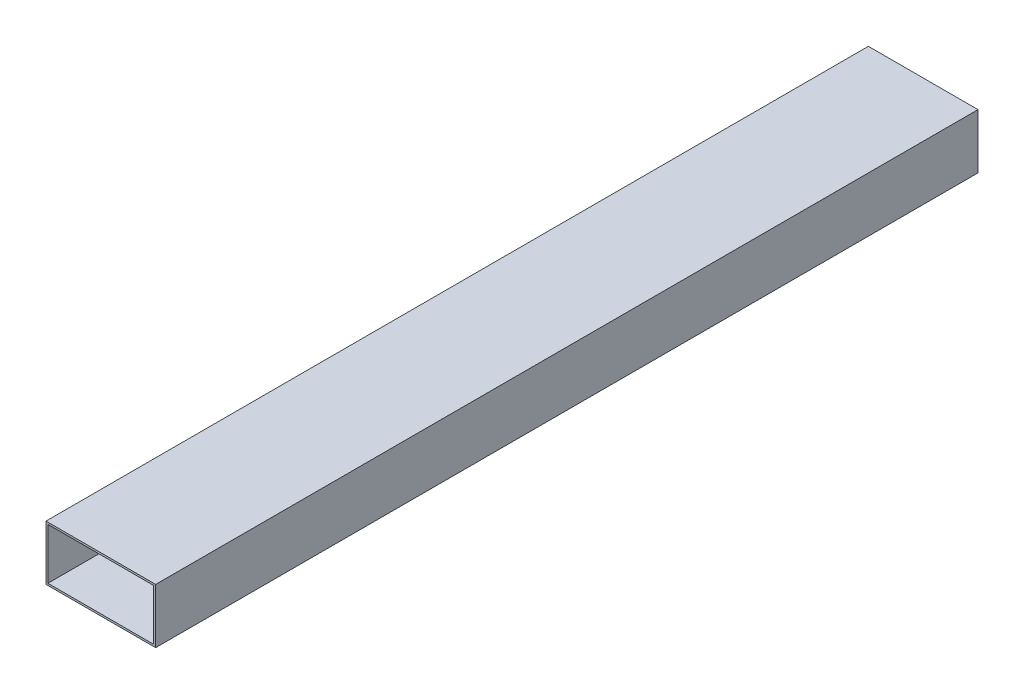
ISO-10303-21;
HEADER;
FILE_DESCRIPTION(('STEP AP214'),'2;1');
FILE_NAME('part.step','',(''),(''),'','','');
FILE_SCHEMA(('AUTOMOTIVE_DESIGN { 1 0 10303 214 1 1 1 1 }'));
ENDSEC;
DATA;
#1=APPLICATION_CONTEXT('core data for automotive mechanical design processes');
#2=APPLICATION_PROTOCOL_DEFINITION('international standard','automotive_design',2000,#1);
#3=PRODUCT_CONTEXT('',#1,'mechanical');
#4=PRODUCT('Part','Part','',(#3));
#5=PRODUCT_RELATED_PRODUCT_CATEGORY('part','',(#4));
#6=PRODUCT_DEFINITION_FORMATION('','',#4);
#7=PRODUCT_DEFINITION_CONTEXT('part definition',#1,'design');
#8=PRODUCT_DEFINITION('design','',#6,#7);
#9=PRODUCT_DEFINITION_SHAPE('','',#8);
#10=(LENGTH_UNIT() NAMED_UNIT(*) SI_UNIT(.MILLI.,.METRE.));
#11=(NAMED_UNIT(*) PLANE_ANGLE_UNIT() SI_UNIT($,.RADIAN.));
#12=(NAMED_UNIT(*) SI_UNIT($,.STERADIAN.) SOLID_ANGLE_UNIT());
#13=UNCERTAINTY_MEASURE_WITH_UNIT(LENGTH_MEASURE(1.E-05),#10,'distance_accuracy_value','');
#14=(GEOMETRIC_REPRESENTATION_CONTEXT(3) GLOBAL_UNCERTAINTY_ASSIGNED_CONTEXT((#13)) GLOBAL_UNIT_ASSIGNED_CONTEXT((#10,
#11,#12)) REPRESENTATION_CONTEXT('',''));
#15=CARTESIAN_POINT('',(0.,0.,0.));
#16=DIRECTION('',(0.,0.,1.));
#17=DIRECTION('',(1.,0.,0.));
#18=AXIS2_PLACEMENT_3D('',#15,#16,#17);
#19=CARTESIAN_POINT('',(0.,0.,190.5));
#20=DIRECTION('',(0.,0.,-1.));
#21=DIRECTION('',(-1.,0.,0.));
#22=AXIS2_PLACEMENT_3D('',#19,#20,#21);
#23=PLANE('',#22);
#24=DIRECTION('',(0.,1.,0.));
#25=VECTOR('',#24,1.);
#26=CARTESIAN_POINT('',(25.4,-12.7,190.5));
#27=LINE('',#26,#25);
#28=CARTESIAN_POINT('',(25.4,-12.7,190.5));
#29=VERTEX_POINT('',#28);
#30=CARTESIAN_POINT('',(25.4,12.7,190.5));
#31=VERTEX_POINT('',#30);
#32=EDGE_CURVE('E141',#29,#31,#27,.T.);
#33=ORIENTED_EDGE('',*,*,#32,.T.);
#34=DIRECTION('',(-1.,0.,0.));
#35=VECTOR('',#34,1.);
#36=CARTESIAN_POINT('',(-25.4,12.7,190.5));
#37=LINE('',#36,#35);
#38=CARTESIAN_POINT('',(-25.4,12.7,190.5));
#39=VERTEX_POINT('',#38);
#40=EDGE_CURVE('E144',#31,#39,#37,.T.);
#41=ORIENTED_EDGE('',*,*,#40,.T.);
#42=DIRECTION('',(0.,-1.,0.));
#43=VECTOR('',#42,1.);
#44=CARTESIAN_POINT('',(-25.4,-12.7,190.5));
#45=LINE('',#44,#43);
#46=CARTESIAN_POINT('',(-25.4,-12.7,190.5));
#47=VERTEX_POINT('',#46);
#48=EDGE_CURVE('E147',#39,#47,#45,.T.);
#49=ORIENTED_EDGE('',*,*,#48,.T.);
#50=DIRECTION('',(1.,0.,0.));
#51=VECTOR('',#50,1.);
#52=CARTESIAN_POINT('',(-25.4,-12.7,190.5));
#53=LINE('',#52,#51);
#54=EDGE_CURVE('E149',#47,#29,#53,.T.);
#55=ORIENTED_EDGE('',*,*,#54,.T.);
#56=EDGE_LOOP('',(#33,#41,#49,#55));
#57=FACE_BOUND('',#56,.T.);
#58=DIRECTION('',(1.,0.,0.));
#59=VECTOR('',#58,1.);
#60=CARTESIAN_POINT('',(-24.511,-11.811,190.5));
#61=LINE('',#60,#59);
#62=CARTESIAN_POINT('',(-24.511,-11.811,190.5));
#63=VERTEX_POINT('',#62);
#64=CARTESIAN_POINT('',(24.511,-11.811,190.5));
#65=VERTEX_POINT('',#64);
#66=EDGE_CURVE('E105',#63,#65,#61,.T.);
#67=ORIENTED_EDGE('',*,*,#66,.F.);
#68=DIRECTION('',(0.,-1.,0.));
#69=VECTOR('',#68,1.);
#70=CARTESIAN_POINT('',(-24.511,-11.811,190.5));
#71=LINE('',#70,#69);
#72=CARTESIAN_POINT('',(-24.511,11.811,190.5));
#73=VERTEX_POINT('',#72);
#74=EDGE_CURVE('E127',#73,#63,#71,.T.);
#75=ORIENTED_EDGE('',*,*,#74,.F.);
#76=DIRECTION('',(-1.,0.,0.));
#77=VECTOR('',#76,1.);
#78=CARTESIAN_POINT('',(-24.511,11.811,190.5));
#79=LINE('',#78,#77);
#80=CARTESIAN_POINT('',(24.511,11.811,190.5));
#81=VERTEX_POINT('',#80);
#82=EDGE_CURVE('E125',#81,#73,#79,.T.);
#83=ORIENTED_EDGE('',*,*,#82,.F.);
#84=DIRECTION('',(0.,1.,0.));
#85=VECTOR('',#84,1.);
#86=CARTESIAN_POINT('',(24.511,-11.811,190.5));
#87=LINE('',#86,#85);
#88=EDGE_CURVE('E113',#65,#81,#87,.T.);
#89=ORIENTED_EDGE('',*,*,#88,.F.);
#90=EDGE_LOOP('',(#67,#75,#83,#89));
#91=FACE_BOUND('',#90,.T.);
#92=ADVANCED_FACE('F40',(#57,#91),#23,.F.);
#93=CARTESIAN_POINT('',(0.,0.,-190.5));
#94=DIRECTION('',(0.,0.,-1.));
#95=DIRECTION('',(-1.,0.,0.));
#96=AXIS2_PLACEMENT_3D('',#93,#94,#95);
#97=PLANE('',#96);
#98=DIRECTION('',(0.,1.,0.));
#99=VECTOR('',#98,1.);
#100=CARTESIAN_POINT('',(25.4,-12.7,-190.5));
#101=LINE('',#100,#99);
#102=CARTESIAN_POINT('',(25.4,-12.7,-190.5));
#103=VERTEX_POINT('',#102);
#104=CARTESIAN_POINT('',(25.4,12.7,-190.5));
#105=VERTEX_POINT('',#104);
#106=EDGE_CURVE('E121',#103,#105,#101,.T.);
#107=ORIENTED_EDGE('',*,*,#106,.F.);
#108=DIRECTION('',(1.,0.,0.));
#109=VECTOR('',#108,1.);
#110=CARTESIAN_POINT('',(-25.4,-12.7,-190.5));
#111=LINE('',#110,#109);
#112=CARTESIAN_POINT('',(-25.4,-12.7,-190.5));
#113=VERTEX_POINT('',#112);
#114=EDGE_CURVE('E145',#113,#103,#111,.T.);
#115=ORIENTED_EDGE('',*,*,#114,.F.);
#116=DIRECTION('',(0.,-1.,0.));
#117=VECTOR('',#116,1.);
#118=CARTESIAN_POINT('',(-25.4,-12.7,-190.5));
#119=LINE('',#118,#117);
#120=CARTESIAN_POINT('',(-25.4,12.7,-190.5));
#121=VERTEX_POINT('',#120);
#122=EDGE_CURVE('E156',#121,#113,#119,.T.);
#123=ORIENTED_EDGE('',*,*,#122,.F.);
#124=DIRECTION('',(-1.,0.,0.));
#125=VECTOR('',#124,1.);
#126=CARTESIAN_POINT('',(-25.4,12.7,-190.5));
#127=LINE('',#126,#125);
#128=EDGE_CURVE('E154',#105,#121,#127,.T.);
#129=ORIENTED_EDGE('',*,*,#128,.F.);
#130=EDGE_LOOP('',(#107,#115,#123,#129));
#131=FACE_BOUND('',#130,.T.);
#132=DIRECTION('',(0.,-1.,0.));
#133=VECTOR('',#132,1.);
#134=CARTESIAN_POINT('',(-24.511,-11.811,-190.5));
#135=LINE('',#134,#133);
#136=CARTESIAN_POINT('',(-24.511,11.811,-190.5));
#137=VERTEX_POINT('',#136);
#138=CARTESIAN_POINT('',(-24.511,-11.811,-190.5));
#139=VERTEX_POINT('',#138);
#140=EDGE_CURVE('E114',#137,#139,#135,.T.);
#141=ORIENTED_EDGE('',*,*,#140,.T.);
#142=DIRECTION('',(1.,0.,0.));
#143=VECTOR('',#142,1.);
#144=CARTESIAN_POINT('',(-24.511,-11.811,-190.5));
#145=LINE('',#144,#143);
#146=CARTESIAN_POINT('',(24.511,-11.811,-190.5));
#147=VERTEX_POINT('',#146);
#148=EDGE_CURVE('E63',#139,#147,#145,.T.);
#149=ORIENTED_EDGE('',*,*,#148,.T.);
#150=DIRECTION('',(0.,1.,0.));
#151=VECTOR('',#150,1.);
#152=CARTESIAN_POINT('',(24.511,-11.811,-190.5));
#153=LINE('',#152,#151);
#154=CARTESIAN_POINT('',(24.511,11.811,-190.5));
#155=VERTEX_POINT('',#154);
#156=EDGE_CURVE('E120',#147,#155,#153,.T.);
#157=ORIENTED_EDGE('',*,*,#156,.T.);
#158=DIRECTION('',(-1.,0.,0.));
#159=VECTOR('',#158,1.);
#160=CARTESIAN_POINT('',(-24.511,11.811,-190.5));
#161=LINE('',#160,#159);
#162=EDGE_CURVE('E133',#155,#137,#161,.T.);
#163=ORIENTED_EDGE('',*,*,#162,.T.);
#164=EDGE_LOOP('',(#141,#149,#157,#163));
#165=FACE_BOUND('',#164,.T.);
#166=ADVANCED_FACE('F174',(#131,#165),#97,.T.);
#167=CARTESIAN_POINT('',(25.4,-12.7,190.5));
#168=DIRECTION('',(-1.,0.,0.));
#169=DIRECTION('',(0.,0.,1.));
#170=AXIS2_PLACEMENT_3D('',#167,#168,#169);
#171=PLANE('',#170);
#172=ORIENTED_EDGE('',*,*,#106,.T.);
#173=DIRECTION('',(0.,0.,-1.));
#174=VECTOR('',#173,1.);
#175=CARTESIAN_POINT('',(25.4,12.7,190.5));
#176=LINE('',#175,#174);
#177=EDGE_CURVE('E11',#31,#105,#176,.T.);
#178=ORIENTED_EDGE('',*,*,#177,.F.);
#179=ORIENTED_EDGE('',*,*,#32,.F.);
#180=DIRECTION('',(0.,0.,-1.));
#181=VECTOR('',#180,1.);
#182=CARTESIAN_POINT('',(25.4,-12.7,190.5));
#183=LINE('',#182,#181);
#184=EDGE_CURVE('E151',#29,#103,#183,.T.);
#185=ORIENTED_EDGE('',*,*,#184,.T.);
#186=EDGE_LOOP('',(#172,#178,#179,#185));
#187=FACE_BOUND('',#186,.T.);
#188=ADVANCED_FACE('F42',(#187),#171,.F.);
#189=CARTESIAN_POINT('',(-25.4,12.7,190.5));
#190=DIRECTION('',(0.,-1.,0.));
#191=DIRECTION('',(0.,0.,-1.));
#192=AXIS2_PLACEMENT_3D('',#189,#190,#191);
#193=PLANE('',#192);
#194=ORIENTED_EDGE('',*,*,#128,.T.);
#195=DIRECTION('',(0.,0.,-1.));
#196=VECTOR('',#195,1.);
#197=CARTESIAN_POINT('',(-25.4,12.7,190.5));
#198=LINE('',#197,#196);
#199=EDGE_CURVE('E48',#39,#121,#198,.T.);
#200=ORIENTED_EDGE('',*,*,#199,.F.);
#201=ORIENTED_EDGE('',*,*,#40,.F.);
#202=ORIENTED_EDGE('',*,*,#177,.T.);
#203=EDGE_LOOP('',(#194,#200,#201,#202));
#204=FACE_BOUND('',#203,.T.);
#205=ADVANCED_FACE('F184',(#204),#193,.F.);
#206=CARTESIAN_POINT('',(-25.4,-12.7,190.5));
#207=DIRECTION('',(1.,0.,0.));
#208=DIRECTION('',(0.,0.,-1.));
#209=AXIS2_PLACEMENT_3D('',#206,#207,#208);
#210=PLANE('',#209);
#211=ORIENTED_EDGE('',*,*,#122,.T.);
#212=DIRECTION('',(0.,0.,-1.));
#213=VECTOR('',#212,1.);
#214=CARTESIAN_POINT('',(-25.4,-12.7,190.5));
#215=LINE('',#214,#213);
#216=EDGE_CURVE('E161',#47,#113,#215,.T.);
#217=ORIENTED_EDGE('',*,*,#216,.F.);
#218=ORIENTED_EDGE('',*,*,#48,.F.);
#219=ORIENTED_EDGE('',*,*,#199,.T.);
#220=EDGE_LOOP('',(#211,#217,#218,#219));
#221=FACE_BOUND('',#220,.T.);
#222=ADVANCED_FACE('F168',(#221),#210,.F.);
#223=CARTESIAN_POINT('',(-25.4,-12.7,190.5));
#224=DIRECTION('',(0.,1.,0.));
#225=DIRECTION('',(0.,0.,1.));
#226=AXIS2_PLACEMENT_3D('',#223,#224,#225);
#227=PLANE('',#226);
#228=ORIENTED_EDGE('',*,*,#114,.T.);
#229=ORIENTED_EDGE('',*,*,#184,.F.);
#230=ORIENTED_EDGE('',*,*,#54,.F.);
#231=ORIENTED_EDGE('',*,*,#216,.T.);
#232=EDGE_LOOP('',(#228,#229,#230,#231));
#233=FACE_BOUND('',#232,.T.);
#234=ADVANCED_FACE('F178',(#233),#227,.F.);
#235=CARTESIAN_POINT('',(-24.511,-11.811,190.5));
#236=DIRECTION('',(0.,1.,0.));
#237=DIRECTION('',(0.,0.,1.));
#238=AXIS2_PLACEMENT_3D('',#235,#236,#237);
#239=PLANE('',#238);
#240=ORIENTED_EDGE('',*,*,#148,.F.);
#241=DIRECTION('',(0.,0.,-1.));
#242=VECTOR('',#241,1.);
#243=CARTESIAN_POINT('',(-24.511,-11.811,190.5));
#244=LINE('',#243,#242);
#245=EDGE_CURVE('E109',#63,#139,#244,.T.);
#246=ORIENTED_EDGE('',*,*,#245,.F.);
#247=ORIENTED_EDGE('',*,*,#66,.T.);
#248=DIRECTION('',(0.,0.,-1.));
#249=VECTOR('',#248,1.);
#250=CARTESIAN_POINT('',(24.511,-11.811,190.5));
#251=LINE('',#250,#249);
#252=EDGE_CURVE('E108',#65,#147,#251,.T.);
#253=ORIENTED_EDGE('',*,*,#252,.T.);
#254=EDGE_LOOP('',(#240,#246,#247,#253));
#255=FACE_BOUND('',#254,.T.);
#256=ADVANCED_FACE('F107',(#255),#239,.T.);
#257=CARTESIAN_POINT('',(24.511,-11.811,190.5));
#258=DIRECTION('',(-1.,0.,0.));
#259=DIRECTION('',(0.,0.,1.));
#260=AXIS2_PLACEMENT_3D('',#257,#258,#259);
#261=PLANE('',#260);
#262=ORIENTED_EDGE('',*,*,#156,.F.);
#263=ORIENTED_EDGE('',*,*,#252,.F.);
#264=ORIENTED_EDGE('',*,*,#88,.T.);
#265=DIRECTION('',(0.,0.,-1.));
#266=VECTOR('',#265,1.);
#267=CARTESIAN_POINT('',(24.511,11.811,190.5));
#268=LINE('',#267,#266);
#269=EDGE_CURVE('E122',#81,#155,#268,.T.);
#270=ORIENTED_EDGE('',*,*,#269,.T.);
#271=EDGE_LOOP('',(#262,#263,#264,#270));
#272=FACE_BOUND('',#271,.T.);
#273=ADVANCED_FACE('F117',(#272),#261,.T.);
#274=CARTESIAN_POINT('',(-24.511,11.811,190.5));
#275=DIRECTION('',(0.,-1.,0.));
#276=DIRECTION('',(1.,0.,0.));
#277=AXIS2_PLACEMENT_3D('',#274,#275,#276);
#278=PLANE('',#277);
#279=ORIENTED_EDGE('',*,*,#162,.F.);
#280=ORIENTED_EDGE('',*,*,#269,.F.);
#281=ORIENTED_EDGE('',*,*,#82,.T.);
#282=DIRECTION('',(0.,0.,-1.));
#283=VECTOR('',#282,1.);
#284=CARTESIAN_POINT('',(-24.511,11.811,190.5));
#285=LINE('',#284,#283);
#286=EDGE_CURVE('E55',#73,#137,#285,.T.);
#287=ORIENTED_EDGE('',*,*,#286,.T.);
#288=EDGE_LOOP('',(#279,#280,#281,#287));
#289=FACE_BOUND('',#288,.T.);
#290=ADVANCED_FACE('F207',(#289),#278,.T.);
#291=CARTESIAN_POINT('',(-24.511,-11.811,190.5));
#292=DIRECTION('',(1.,0.,0.));
#293=DIRECTION('',(0.,0.,-1.));
#294=AXIS2_PLACEMENT_3D('',#291,#292,#293);
#295=PLANE('',#294);
#296=ORIENTED_EDGE('',*,*,#140,.F.);
#297=ORIENTED_EDGE('',*,*,#286,.F.);
#298=ORIENTED_EDGE('',*,*,#74,.T.);
#299=ORIENTED_EDGE('',*,*,#245,.T.);
#300=EDGE_LOOP('',(#296,#297,#298,#299));
#301=FACE_BOUND('',#300,.T.);
#302=ADVANCED_FACE('F211',(#301),#295,.T.);
#303=CLOSED_SHELL('',(#92,#166,#188,#205,#222,#234,#256,#273,#290,#302));
#304=MANIFOLD_SOLID_BREP('B2',#303);
#305=ADVANCED_BREP_SHAPE_REPRESENTATION('',(#18,#304),#14);
#306=SHAPE_DEFINITION_REPRESENTATION(#9,#305);
ENDSEC;
END-ISO-10303-21;
